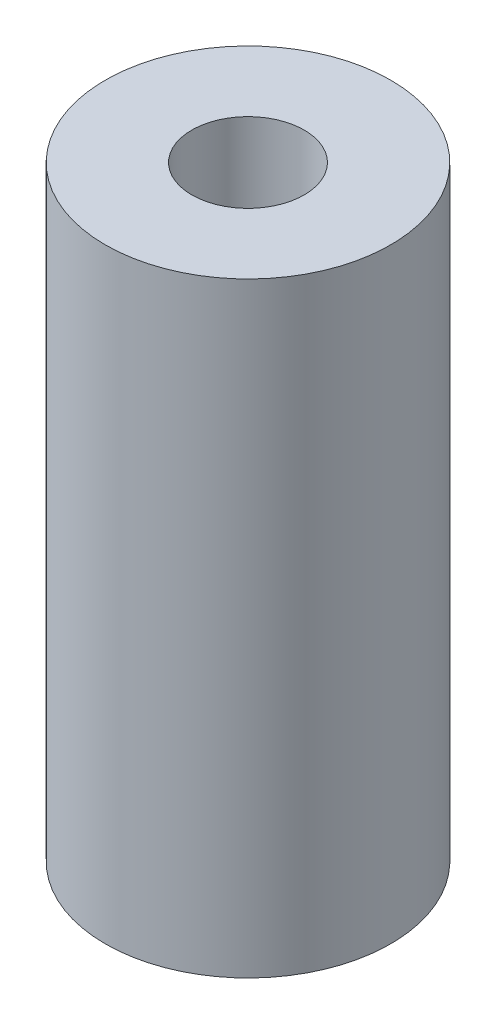
ISO-10303-21;
HEADER;
FILE_DESCRIPTION(('STEP AP214'),'2;1');
FILE_NAME('part.step','',(''),(''),'','','');
FILE_SCHEMA(('AUTOMOTIVE_DESIGN { 1 0 10303 214 1 1 1 1 }'));
ENDSEC;
DATA;
#1=APPLICATION_CONTEXT('core data for automotive mechanical design processes');
#2=APPLICATION_PROTOCOL_DEFINITION('international standard','automotive_design',2000,#1);
#3=PRODUCT_CONTEXT('',#1,'mechanical');
#4=PRODUCT('Part','Part','',(#3));
#5=PRODUCT_RELATED_PRODUCT_CATEGORY('part','',(#4));
#6=PRODUCT_DEFINITION_FORMATION('','',#4);
#7=PRODUCT_DEFINITION_CONTEXT('part definition',#1,'design');
#8=PRODUCT_DEFINITION('design','',#6,#7);
#9=PRODUCT_DEFINITION_SHAPE('','',#8);
#10=(LENGTH_UNIT() NAMED_UNIT(*) SI_UNIT(.MILLI.,.METRE.));
#11=(NAMED_UNIT(*) PLANE_ANGLE_UNIT() SI_UNIT($,.RADIAN.));
#12=(NAMED_UNIT(*) SI_UNIT($,.STERADIAN.) SOLID_ANGLE_UNIT());
#13=UNCERTAINTY_MEASURE_WITH_UNIT(LENGTH_MEASURE(1.E-05),#10,'distance_accuracy_value','');
#14=(GEOMETRIC_REPRESENTATION_CONTEXT(3) GLOBAL_UNCERTAINTY_ASSIGNED_CONTEXT((#13)) GLOBAL_UNIT_ASSIGNED_CONTEXT((#10,
#11,#12)) REPRESENTATION_CONTEXT('',''));
#15=CARTESIAN_POINT('',(0.,0.,0.));
#16=DIRECTION('',(0.,0.,1.));
#17=DIRECTION('',(1.,0.,0.));
#18=AXIS2_PLACEMENT_3D('',#15,#16,#17);
#19=CARTESIAN_POINT('',(0.,17.78,0.));
#20=DIRECTION('',(0.,1.,0.));
#21=DIRECTION('',(0.,0.,1.));
#22=AXIS2_PLACEMENT_3D('',#19,#20,#21);
#23=PLANE('',#22);
#24=CARTESIAN_POINT('',(0.,17.78,0.));
#25=DIRECTION('',(0.,1.,0.));
#26=DIRECTION('',(0.,0.,1.));
#27=AXIS2_PLACEMENT_3D('',#24,#25,#26);
#28=CIRCLE('',#27,4.191);
#29=CARTESIAN_POINT('',(0.,17.78,4.191));
#30=VERTEX_POINT('',#29);
#31=EDGE_CURVE('E11',#30,#30,#28,.T.);
#32=ORIENTED_EDGE('',*,*,#31,.T.);
#33=EDGE_LOOP('',(#32));
#34=FACE_BOUND('',#33,.T.);
#35=CARTESIAN_POINT('',(0.,17.78,0.));
#36=DIRECTION('',(0.,1.,0.));
#37=DIRECTION('',(0.,0.,1.));
#38=AXIS2_PLACEMENT_3D('',#35,#36,#37);
#39=CIRCLE('',#38,1.651);
#40=CARTESIAN_POINT('',(0.,17.78,1.651));
#41=VERTEX_POINT('',#40);
#42=EDGE_CURVE('E48',#41,#41,#39,.T.);
#43=ORIENTED_EDGE('',*,*,#42,.F.);
#44=EDGE_LOOP('',(#43));
#45=FACE_BOUND('',#44,.T.);
#46=ADVANCED_FACE('F37',(#34,#45),#23,.T.);
#47=CARTESIAN_POINT('',(0.,0.,0.));
#48=DIRECTION('',(0.,1.,0.));
#49=DIRECTION('',(0.,0.,1.));
#50=AXIS2_PLACEMENT_3D('',#47,#48,#49);
#51=PLANE('',#50);
#52=CARTESIAN_POINT('',(0.,0.,0.));
#53=DIRECTION('',(0.,1.,0.));
#54=DIRECTION('',(0.,0.,1.));
#55=AXIS2_PLACEMENT_3D('',#52,#53,#54);
#56=CIRCLE('',#55,4.191);
#57=CARTESIAN_POINT('',(0.,0.,4.191));
#58=VERTEX_POINT('',#57);
#59=EDGE_CURVE('E41',#58,#58,#56,.T.);
#60=ORIENTED_EDGE('',*,*,#59,.F.);
#61=EDGE_LOOP('',(#60));
#62=FACE_BOUND('',#61,.T.);
#63=CARTESIAN_POINT('',(0.,0.,0.));
#64=DIRECTION('',(0.,1.,0.));
#65=DIRECTION('',(0.,0.,1.));
#66=AXIS2_PLACEMENT_3D('',#63,#64,#65);
#67=CIRCLE('',#66,1.651);
#68=CARTESIAN_POINT('',(0.,0.,1.651));
#69=VERTEX_POINT('',#68);
#70=EDGE_CURVE('E50',#69,#69,#67,.T.);
#71=ORIENTED_EDGE('',*,*,#70,.T.);
#72=EDGE_LOOP('',(#71));
#73=FACE_BOUND('',#72,.T.);
#74=ADVANCED_FACE('F60',(#62,#73),#51,.F.);
#75=CARTESIAN_POINT('',(0.,17.78,0.));
#76=DIRECTION('',(0.,-1.,0.));
#77=DIRECTION('',(0.,0.,-1.));
#78=AXIS2_PLACEMENT_3D('',#75,#76,#77);
#79=CYLINDRICAL_SURFACE('',#78,4.191);
#80=ORIENTED_EDGE('',*,*,#31,.F.);
#81=EDGE_LOOP('',(#80));
#82=FACE_BOUND('',#81,.T.);
#83=ORIENTED_EDGE('',*,*,#59,.T.);
#84=EDGE_LOOP('',(#83));
#85=FACE_BOUND('',#84,.T.);
#86=ADVANCED_FACE('F39',(#82,#85),#79,.T.);
#87=CARTESIAN_POINT('',(0.,17.78,0.));
#88=DIRECTION('',(0.,-1.,0.));
#89=DIRECTION('',(0.,0.,-1.));
#90=AXIS2_PLACEMENT_3D('',#87,#88,#89);
#91=CYLINDRICAL_SURFACE('',#90,1.651);
#92=ORIENTED_EDGE('',*,*,#42,.T.);
#93=EDGE_LOOP('',(#92));
#94=FACE_BOUND('',#93,.T.);
#95=ORIENTED_EDGE('',*,*,#70,.F.);
#96=EDGE_LOOP('',(#95));
#97=FACE_BOUND('',#96,.T.);
#98=ADVANCED_FACE('F56',(#94,#97),#91,.F.);
#99=CLOSED_SHELL('',(#46,#74,#86,#98));
#100=MANIFOLD_SOLID_BREP('B2',#99);
#101=ADVANCED_BREP_SHAPE_REPRESENTATION('',(#18,#100),#14);
#102=SHAPE_DEFINITION_REPRESENTATION(#9,#101);
ENDSEC;
END-ISO-10303-21;
